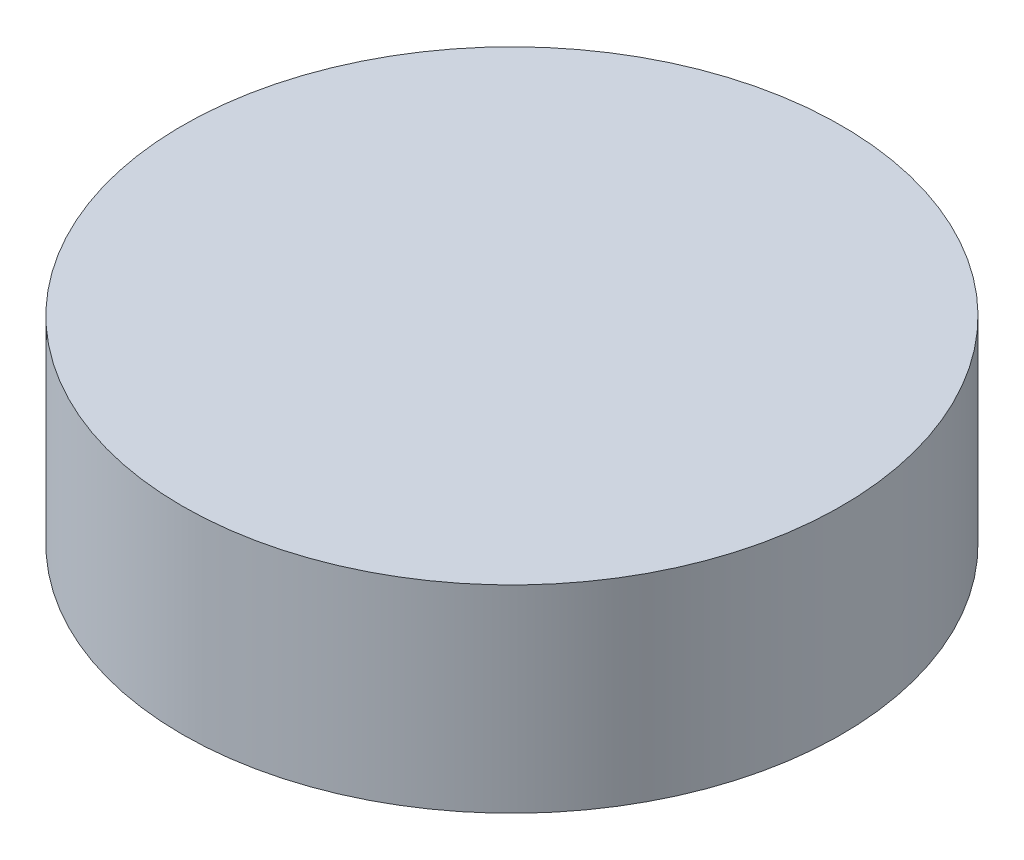
ISO-10303-21;
HEADER;
FILE_DESCRIPTION(('STEP AP214'),'2;1');
FILE_NAME('part.step','',(''),(''),'','','');
FILE_SCHEMA(('AUTOMOTIVE_DESIGN { 1 0 10303 214 1 1 1 1 }'));
ENDSEC;
DATA;
#1=APPLICATION_CONTEXT('core data for automotive mechanical design processes');
#2=APPLICATION_PROTOCOL_DEFINITION('international standard','automotive_design',2000,#1);
#3=PRODUCT_CONTEXT('',#1,'mechanical');
#4=PRODUCT('Part','Part','',(#3));
#5=PRODUCT_RELATED_PRODUCT_CATEGORY('part','',(#4));
#6=PRODUCT_DEFINITION_FORMATION('','',#4);
#7=PRODUCT_DEFINITION_CONTEXT('part definition',#1,'design');
#8=PRODUCT_DEFINITION('design','',#6,#7);
#9=PRODUCT_DEFINITION_SHAPE('','',#8);
#10=(LENGTH_UNIT() NAMED_UNIT(*) SI_UNIT(.MILLI.,.METRE.));
#11=(NAMED_UNIT(*) PLANE_ANGLE_UNIT() SI_UNIT($,.RADIAN.));
#12=(NAMED_UNIT(*) SI_UNIT($,.STERADIAN.) SOLID_ANGLE_UNIT());
#13=UNCERTAINTY_MEASURE_WITH_UNIT(LENGTH_MEASURE(1.E-05),#10,'distance_accuracy_value','');
#14=(GEOMETRIC_REPRESENTATION_CONTEXT(3) GLOBAL_UNCERTAINTY_ASSIGNED_CONTEXT((#13)) GLOBAL_UNIT_ASSIGNED_CONTEXT((#10,
#11,#12)) REPRESENTATION_CONTEXT('',''));
#15=CARTESIAN_POINT('',(0.,0.,0.));
#16=DIRECTION('',(0.,0.,1.));
#17=DIRECTION('',(1.,0.,0.));
#18=AXIS2_PLACEMENT_3D('',#15,#16,#17);
#19=CARTESIAN_POINT('',(0.,24.,0.));
#20=DIRECTION('',(0.,-1.,0.));
#21=DIRECTION('',(0.,0.,-1.));
#22=AXIS2_PLACEMENT_3D('',#19,#20,#21);
#23=CYLINDRICAL_SURFACE('',#22,40.);
#24=CARTESIAN_POINT('',(0.,24.,0.));
#25=DIRECTION('',(0.,1.,0.));
#26=DIRECTION('',(0.,0.,1.));
#27=AXIS2_PLACEMENT_3D('',#24,#25,#26);
#28=CIRCLE('',#27,40.);
#29=CARTESIAN_POINT('',(0.,24.,40.));
#30=VERTEX_POINT('',#29);
#31=EDGE_CURVE('E10',#30,#30,#28,.T.);
#32=ORIENTED_EDGE('',*,*,#31,.F.);
#33=EDGE_LOOP('',(#32));
#34=FACE_BOUND('',#33,.T.);
#35=CARTESIAN_POINT('',(0.,0.,0.));
#36=DIRECTION('',(0.,1.,0.));
#37=DIRECTION('',(0.,0.,1.));
#38=AXIS2_PLACEMENT_3D('',#35,#36,#37);
#39=CIRCLE('',#38,40.);
#40=CARTESIAN_POINT('',(0.,0.,40.));
#41=VERTEX_POINT('',#40);
#42=EDGE_CURVE('E34',#41,#41,#39,.T.);
#43=ORIENTED_EDGE('',*,*,#42,.T.);
#44=EDGE_LOOP('',(#43));
#45=FACE_BOUND('',#44,.T.);
#46=ADVANCED_FACE('F31',(#34,#45),#23,.T.);
#47=CARTESIAN_POINT('',(0.,24.,0.));
#48=DIRECTION('',(0.,1.,0.));
#49=DIRECTION('',(0.,0.,1.));
#50=AXIS2_PLACEMENT_3D('',#47,#48,#49);
#51=PLANE('',#50);
#52=ORIENTED_EDGE('',*,*,#31,.T.);
#53=EDGE_LOOP('',(#52));
#54=FACE_BOUND('',#53,.T.);
#55=ADVANCED_FACE('F46',(#54),#51,.T.);
#56=CARTESIAN_POINT('',(0.,0.,0.));
#57=DIRECTION('',(0.,1.,0.));
#58=DIRECTION('',(0.,0.,1.));
#59=AXIS2_PLACEMENT_3D('',#56,#57,#58);
#60=PLANE('',#59);
#61=ORIENTED_EDGE('',*,*,#42,.F.);
#62=EDGE_LOOP('',(#61));
#63=FACE_BOUND('',#62,.T.);
#64=ADVANCED_FACE('F44',(#63),#60,.F.);
#65=CLOSED_SHELL('',(#46,#55,#64));
#66=MANIFOLD_SOLID_BREP('B2',#65);
#67=ADVANCED_BREP_SHAPE_REPRESENTATION('',(#18,#66),#14);
#68=SHAPE_DEFINITION_REPRESENTATION(#9,#67);
ENDSEC;
END-ISO-10303-21;
